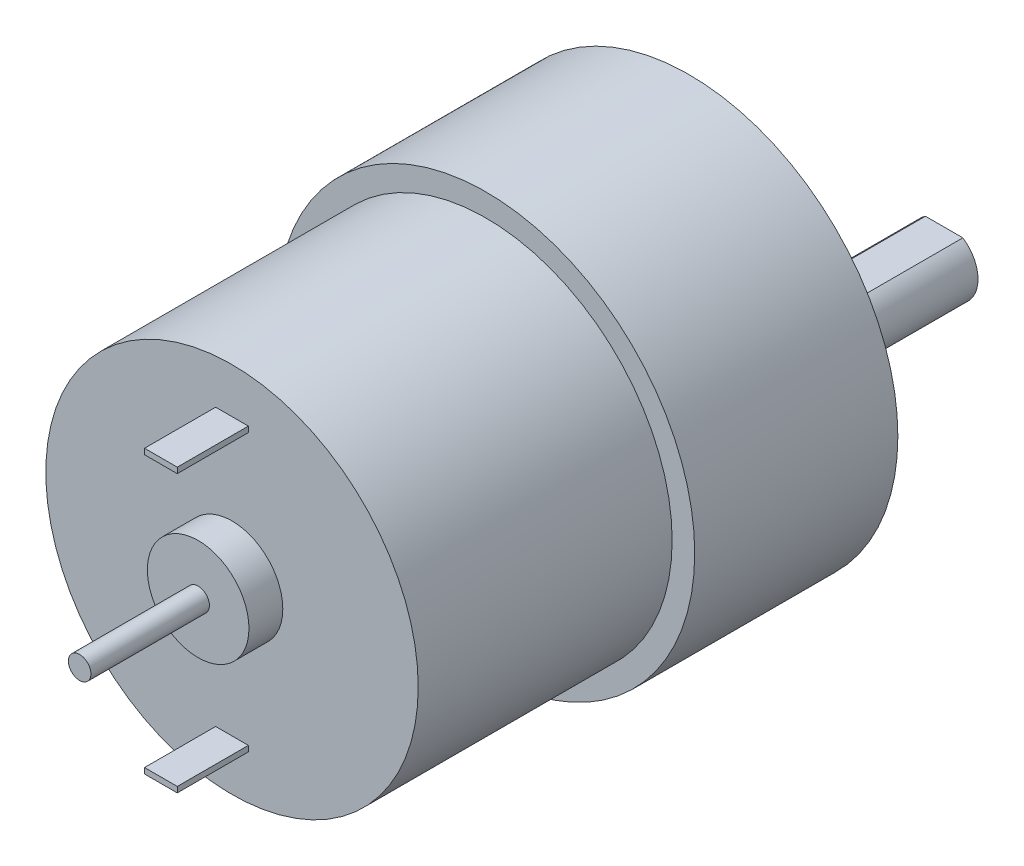
ISO-10303-21;
HEADER;
FILE_DESCRIPTION(('STEP AP214'),'2;1');
FILE_NAME('part.step','',(''),(''),'','','');
FILE_SCHEMA(('AUTOMOTIVE_DESIGN { 1 0 10303 214 1 1 1 1 }'));
ENDSEC;
DATA;
#1=APPLICATION_CONTEXT('core data for automotive mechanical design processes');
#2=APPLICATION_PROTOCOL_DEFINITION('international standard','automotive_design',2000,#1);
#3=PRODUCT_CONTEXT('',#1,'mechanical');
#4=PRODUCT('Part','Part','',(#3));
#5=PRODUCT_RELATED_PRODUCT_CATEGORY('part','',(#4));
#6=PRODUCT_DEFINITION_FORMATION('','',#4);
#7=PRODUCT_DEFINITION_CONTEXT('part definition',#1,'design');
#8=PRODUCT_DEFINITION('design','',#6,#7);
#9=PRODUCT_DEFINITION_SHAPE('','',#8);
#10=(LENGTH_UNIT() NAMED_UNIT(*) SI_UNIT(.MILLI.,.METRE.));
#11=(NAMED_UNIT(*) PLANE_ANGLE_UNIT() SI_UNIT($,.RADIAN.));
#12=(NAMED_UNIT(*) SI_UNIT($,.STERADIAN.) SOLID_ANGLE_UNIT());
#13=UNCERTAINTY_MEASURE_WITH_UNIT(LENGTH_MEASURE(1.E-05),#10,'distance_accuracy_value','');
#14=(GEOMETRIC_REPRESENTATION_CONTEXT(3) GLOBAL_UNCERTAINTY_ASSIGNED_CONTEXT((#13)) GLOBAL_UNIT_ASSIGNED_CONTEXT((#10,
#11,#12)) REPRESENTATION_CONTEXT('',''));
#15=CARTESIAN_POINT('',(0.,0.,0.));
#16=DIRECTION('',(0.,0.,1.));
#17=DIRECTION('',(1.,0.,0.));
#18=AXIS2_PLACEMENT_3D('',#15,#16,#17);
#19=CARTESIAN_POINT('',(0.,-7.,-4.6));
#20=DIRECTION('',(0.,0.,-1.));
#21=DIRECTION('',(-1.,0.,0.));
#22=AXIS2_PLACEMENT_3D('',#19,#20,#21);
#23=PLANE('',#22);
#24=CARTESIAN_POINT('',(0.,-7.,-4.6));
#25=DIRECTION('',(0.,0.,-1.));
#26=DIRECTION('',(-1.,0.,0.));
#27=AXIS2_PLACEMENT_3D('',#24,#25,#26);
#28=CIRCLE('',#27,6.);
#29=CARTESIAN_POINT('',(-6.,-7.,-4.6));
#30=VERTEX_POINT('',#29);
#31=EDGE_CURVE('E143',#30,#30,#28,.T.);
#32=ORIENTED_EDGE('',*,*,#31,.T.);
#33=EDGE_LOOP('',(#32));
#34=FACE_BOUND('',#33,.T.);
#35=CARTESIAN_POINT('',(0.,-7.,-4.6));
#36=DIRECTION('',(0.,0.,-1.));
#37=DIRECTION('',(-1.,0.,0.));
#38=AXIS2_PLACEMENT_3D('',#35,#36,#37);
#39=CIRCLE('',#38,3.);
#40=CARTESIAN_POINT('',(-3.,-7.,-4.6));
#41=VERTEX_POINT('',#40);
#42=EDGE_CURVE('E129',#41,#41,#39,.T.);
#43=ORIENTED_EDGE('',*,*,#42,.F.);
#44=EDGE_LOOP('',(#43));
#45=FACE_BOUND('',#44,.T.);
#46=ADVANCED_FACE('F32',(#34,#45),#23,.T.);
#47=CARTESIAN_POINT('',(0.,0.,0.));
#48=DIRECTION('',(0.,0.,1.));
#49=DIRECTION('',(1.,0.,0.));
#50=AXIS2_PLACEMENT_3D('',#47,#48,#49);
#51=PLANE('',#50);
#52=CARTESIAN_POINT('',(-15.5,0.,0.));
#53=DIRECTION('',(0.,0.,-1.));
#54=DIRECTION('',(-1.,0.,0.));
#55=AXIS2_PLACEMENT_3D('',#52,#53,#54);
#56=CIRCLE('',#55,1.5);
#57=CARTESIAN_POINT('',(-17.,0.,0.));
#58=VERTEX_POINT('',#57);
#59=EDGE_CURVE('E510',#58,#58,#56,.T.);
#60=ORIENTED_EDGE('',*,*,#59,.F.);
#61=EDGE_LOOP('',(#60));
#62=FACE_BOUND('',#61,.T.);
#63=CARTESIAN_POINT('',(7.75000000000006,-13.4233937586588,0.));
#64=DIRECTION('',(0.,0.,-1.));
#65=DIRECTION('',(-1.,0.,0.));
#66=AXIS2_PLACEMENT_3D('',#63,#64,#65);
#67=CIRCLE('',#66,1.5);
#68=CARTESIAN_POINT('',(6.25000000000006,-13.4233937586588,0.));
#69=VERTEX_POINT('',#68);
#70=EDGE_CURVE('E509',#69,#69,#67,.T.);
#71=ORIENTED_EDGE('',*,*,#70,.F.);
#72=EDGE_LOOP('',(#71));
#73=FACE_BOUND('',#72,.T.);
#74=CARTESIAN_POINT('',(15.5,0.,0.));
#75=DIRECTION('',(0.,0.,-1.));
#76=DIRECTION('',(-1.,0.,0.));
#77=AXIS2_PLACEMENT_3D('',#74,#75,#76);
#78=CIRCLE('',#77,1.5);
#79=CARTESIAN_POINT('',(14.,0.,0.));
#80=VERTEX_POINT('',#79);
#81=EDGE_CURVE('E519',#80,#80,#78,.T.);
#82=ORIENTED_EDGE('',*,*,#81,.F.);
#83=EDGE_LOOP('',(#82));
#84=FACE_BOUND('',#83,.T.);
#85=CARTESIAN_POINT('',(7.74999999999997,13.4233937586588,0.));
#86=DIRECTION('',(0.,0.,-1.));
#87=DIRECTION('',(-1.,0.,0.));
#88=AXIS2_PLACEMENT_3D('',#85,#86,#87);
#89=CIRCLE('',#88,1.5);
#90=CARTESIAN_POINT('',(6.24999999999997,13.4233937586588,0.));
#91=VERTEX_POINT('',#90);
#92=EDGE_CURVE('E524',#91,#91,#89,.T.);
#93=ORIENTED_EDGE('',*,*,#92,.F.);
#94=EDGE_LOOP('',(#93));
#95=FACE_BOUND('',#94,.T.);
#96=CARTESIAN_POINT('',(0.,0.,0.));
#97=DIRECTION('',(0.,0.,1.));
#98=DIRECTION('',(1.,0.,0.));
#99=AXIS2_PLACEMENT_3D('',#96,#97,#98);
#100=CIRCLE('',#99,18.5);
#101=CARTESIAN_POINT('',(18.5,0.,0.));
#102=VERTEX_POINT('',#101);
#103=EDGE_CURVE('E218',#102,#102,#100,.T.);
#104=ORIENTED_EDGE('',*,*,#103,.F.);
#105=EDGE_LOOP('',(#104));
#106=FACE_BOUND('',#105,.T.);
#107=CARTESIAN_POINT('',(0.,-7.,0.));
#108=DIRECTION('',(0.,0.,1.));
#109=DIRECTION('',(1.,0.,0.));
#110=AXIS2_PLACEMENT_3D('',#107,#108,#109);
#111=CIRCLE('',#110,6.);
#112=CARTESIAN_POINT('',(6.,-7.,0.));
#113=VERTEX_POINT('',#112);
#114=EDGE_CURVE('E11',#113,#113,#111,.F.);
#115=ORIENTED_EDGE('',*,*,#114,.F.);
#116=EDGE_LOOP('',(#115));
#117=FACE_BOUND('',#116,.T.);
#118=ADVANCED_FACE('F236',(#62,#73,#84,#95,#106,#117),#51,.F.);
#119=CARTESIAN_POINT('',(0.,0.,40.5));
#120=DIRECTION('',(0.,0.,1.));
#121=DIRECTION('',(1.,0.,0.));
#122=AXIS2_PLACEMENT_3D('',#119,#120,#121);
#123=PLANE('',#122);
#124=DIRECTION('',(1.,0.,0.));
#125=VECTOR('',#124,1.);
#126=CARTESIAN_POINT('',(1.45,-12.5,40.5));
#127=LINE('',#126,#125);
#128=CARTESIAN_POINT('',(-1.45,-12.5,40.5));
#129=VERTEX_POINT('',#128);
#130=CARTESIAN_POINT('',(1.45,-12.5,40.5));
#131=VERTEX_POINT('',#130);
#132=EDGE_CURVE('E187',#129,#131,#127,.T.);
#133=ORIENTED_EDGE('',*,*,#132,.F.);
#134=DIRECTION('',(0.,-1.,0.));
#135=VECTOR('',#134,1.);
#136=CARTESIAN_POINT('',(-1.45,-12.5,40.5));
#137=LINE('',#136,#135);
#138=CARTESIAN_POINT('',(-1.45,-12.,40.5));
#139=VERTEX_POINT('',#138);
#140=EDGE_CURVE('E173',#139,#129,#137,.T.);
#141=ORIENTED_EDGE('',*,*,#140,.F.);
#142=DIRECTION('',(-1.,0.,0.));
#143=VECTOR('',#142,1.);
#144=CARTESIAN_POINT('',(1.45,-12.,40.5));
#145=LINE('',#144,#143);
#146=CARTESIAN_POINT('',(1.45,-12.,40.5));
#147=VERTEX_POINT('',#146);
#148=EDGE_CURVE('E178',#147,#139,#145,.T.);
#149=ORIENTED_EDGE('',*,*,#148,.F.);
#150=DIRECTION('',(0.,1.,0.));
#151=VECTOR('',#150,1.);
#152=CARTESIAN_POINT('',(1.45,-12.5,40.5));
#153=LINE('',#152,#151);
#154=EDGE_CURVE('E189',#131,#147,#153,.T.);
#155=ORIENTED_EDGE('',*,*,#154,.F.);
#156=EDGE_LOOP('',(#133,#141,#149,#155));
#157=FACE_BOUND('',#156,.T.);
#158=CARTESIAN_POINT('',(0.,0.,40.5));
#159=DIRECTION('',(0.,0.,1.));
#160=DIRECTION('',(1.,0.,0.));
#161=AXIS2_PLACEMENT_3D('',#158,#159,#160);
#162=CIRCLE('',#161,16.5);
#163=CARTESIAN_POINT('',(16.5,0.,40.5));
#164=VERTEX_POINT('',#163);
#165=EDGE_CURVE('E215',#164,#164,#162,.T.);
#166=ORIENTED_EDGE('',*,*,#165,.T.);
#167=EDGE_LOOP('',(#166));
#168=FACE_BOUND('',#167,.T.);
#169=CARTESIAN_POINT('',(0.,0.,40.5));
#170=DIRECTION('',(0.,0.,1.));
#171=DIRECTION('',(1.,0.,0.));
#172=AXIS2_PLACEMENT_3D('',#169,#170,#171);
#173=CIRCLE('',#172,4.5);
#174=CARTESIAN_POINT('',(4.5,0.,40.5));
#175=VERTEX_POINT('',#174);
#176=EDGE_CURVE('E206',#175,#175,#173,.T.);
#177=ORIENTED_EDGE('',*,*,#176,.F.);
#178=EDGE_LOOP('',(#177));
#179=FACE_BOUND('',#178,.T.);
#180=DIRECTION('',(1.,0.,0.));
#181=VECTOR('',#180,1.);
#182=CARTESIAN_POINT('',(1.45,12.,40.5));
#183=LINE('',#182,#181);
#184=CARTESIAN_POINT('',(-1.45,12.,40.5));
#185=VERTEX_POINT('',#184);
#186=CARTESIAN_POINT('',(1.45,12.,40.5));
#187=VERTEX_POINT('',#186);
#188=EDGE_CURVE('E160',#185,#187,#183,.T.);
#189=ORIENTED_EDGE('',*,*,#188,.F.);
#190=DIRECTION('',(0.,-1.,0.));
#191=VECTOR('',#190,1.);
#192=CARTESIAN_POINT('',(-1.45,12.5,40.5));
#193=LINE('',#192,#191);
#194=CARTESIAN_POINT('',(-1.45,12.5,40.5));
#195=VERTEX_POINT('',#194);
#196=EDGE_CURVE('E146',#195,#185,#193,.T.);
#197=ORIENTED_EDGE('',*,*,#196,.F.);
#198=DIRECTION('',(-1.,0.,0.));
#199=VECTOR('',#198,1.);
#200=CARTESIAN_POINT('',(1.45,12.5,40.5));
#201=LINE('',#200,#199);
#202=CARTESIAN_POINT('',(1.45,12.5,40.5));
#203=VERTEX_POINT('',#202);
#204=EDGE_CURVE('E151',#203,#195,#201,.T.);
#205=ORIENTED_EDGE('',*,*,#204,.F.);
#206=DIRECTION('',(0.,1.,0.));
#207=VECTOR('',#206,1.);
#208=CARTESIAN_POINT('',(1.45,12.5,40.5));
#209=LINE('',#208,#207);
#210=EDGE_CURVE('E162',#187,#203,#209,.T.);
#211=ORIENTED_EDGE('',*,*,#210,.F.);
#212=EDGE_LOOP('',(#189,#197,#205,#211));
#213=FACE_BOUND('',#212,.T.);
#214=ADVANCED_FACE('F243',(#157,#168,#179,#213),#123,.T.);
#215=CARTESIAN_POINT('',(0.,0.,43.5));
#216=DIRECTION('',(0.,0.,1.));
#217=DIRECTION('',(1.,0.,0.));
#218=AXIS2_PLACEMENT_3D('',#215,#216,#217);
#219=PLANE('',#218);
#220=CARTESIAN_POINT('',(0.,0.,43.5));
#221=DIRECTION('',(0.,0.,1.));
#222=DIRECTION('',(1.,0.,0.));
#223=AXIS2_PLACEMENT_3D('',#220,#221,#222);
#224=CIRCLE('',#223,4.5);
#225=CARTESIAN_POINT('',(4.5,0.,43.5));
#226=VERTEX_POINT('',#225);
#227=EDGE_CURVE('E209',#226,#226,#224,.T.);
#228=ORIENTED_EDGE('',*,*,#227,.T.);
#229=EDGE_LOOP('',(#228));
#230=FACE_BOUND('',#229,.T.);
#231=CARTESIAN_POINT('',(0.,0.,43.5));
#232=DIRECTION('',(0.,0.,1.));
#233=DIRECTION('',(1.,0.,0.));
#234=AXIS2_PLACEMENT_3D('',#231,#232,#233);
#235=CIRCLE('',#234,1.);
#236=CARTESIAN_POINT('',(1.,0.,43.5));
#237=VERTEX_POINT('',#236);
#238=EDGE_CURVE('E202',#237,#237,#235,.T.);
#239=ORIENTED_EDGE('',*,*,#238,.F.);
#240=EDGE_LOOP('',(#239));
#241=FACE_BOUND('',#240,.T.);
#242=ADVANCED_FACE('F298',(#230,#241),#219,.T.);
#243=CARTESIAN_POINT('',(0.,0.,18.));
#244=DIRECTION('',(0.,0.,1.));
#245=DIRECTION('',(1.,0.,0.));
#246=AXIS2_PLACEMENT_3D('',#243,#244,#245);
#247=PLANE('',#246);
#248=CARTESIAN_POINT('',(0.,0.,18.));
#249=DIRECTION('',(0.,0.,1.));
#250=DIRECTION('',(1.,0.,0.));
#251=AXIS2_PLACEMENT_3D('',#248,#249,#250);
#252=CIRCLE('',#251,18.5);
#253=CARTESIAN_POINT('',(18.5,0.,18.));
#254=VERTEX_POINT('',#253);
#255=EDGE_CURVE('E41',#254,#254,#252,.T.);
#256=ORIENTED_EDGE('',*,*,#255,.T.);
#257=EDGE_LOOP('',(#256));
#258=FACE_BOUND('',#257,.T.);
#259=CARTESIAN_POINT('',(0.,0.,18.));
#260=DIRECTION('',(0.,0.,1.));
#261=DIRECTION('',(1.,0.,0.));
#262=AXIS2_PLACEMENT_3D('',#259,#260,#261);
#263=CIRCLE('',#262,16.5);
#264=CARTESIAN_POINT('',(16.5,0.,18.));
#265=VERTEX_POINT('',#264);
#266=EDGE_CURVE('E212',#265,#265,#263,.T.);
#267=ORIENTED_EDGE('',*,*,#266,.F.);
#268=EDGE_LOOP('',(#267));
#269=FACE_BOUND('',#268,.T.);
#270=ADVANCED_FACE('F301',(#258,#269),#247,.T.);
#271=CARTESIAN_POINT('',(0.,0.,18.));
#272=DIRECTION('',(0.,0.,-1.));
#273=DIRECTION('',(-1.,0.,0.));
#274=AXIS2_PLACEMENT_3D('',#271,#272,#273);
#275=CYLINDRICAL_SURFACE('',#274,18.5);
#276=ORIENTED_EDGE('',*,*,#255,.F.);
#277=EDGE_LOOP('',(#276));
#278=FACE_BOUND('',#277,.T.);
#279=ORIENTED_EDGE('',*,*,#103,.T.);
#280=EDGE_LOOP('',(#279));
#281=FACE_BOUND('',#280,.T.);
#282=ADVANCED_FACE('F34',(#278,#281),#275,.T.);
#283=CARTESIAN_POINT('',(0.,0.,40.5));
#284=DIRECTION('',(0.,0.,-1.));
#285=DIRECTION('',(-1.,0.,0.));
#286=AXIS2_PLACEMENT_3D('',#283,#284,#285);
#287=CYLINDRICAL_SURFACE('',#286,16.5);
#288=ORIENTED_EDGE('',*,*,#165,.F.);
#289=EDGE_LOOP('',(#288));
#290=FACE_BOUND('',#289,.T.);
#291=ORIENTED_EDGE('',*,*,#266,.T.);
#292=EDGE_LOOP('',(#291));
#293=FACE_BOUND('',#292,.T.);
#294=ADVANCED_FACE('F305',(#290,#293),#287,.T.);
#295=CARTESIAN_POINT('',(0.,0.,43.5));
#296=DIRECTION('',(0.,0.,-1.));
#297=DIRECTION('',(-1.,0.,0.));
#298=AXIS2_PLACEMENT_3D('',#295,#296,#297);
#299=CYLINDRICAL_SURFACE('',#298,4.5);
#300=ORIENTED_EDGE('',*,*,#227,.F.);
#301=EDGE_LOOP('',(#300));
#302=FACE_BOUND('',#301,.T.);
#303=ORIENTED_EDGE('',*,*,#176,.T.);
#304=EDGE_LOOP('',(#303));
#305=FACE_BOUND('',#304,.T.);
#306=ADVANCED_FACE('F296',(#302,#305),#299,.T.);
#307=CARTESIAN_POINT('',(0.,0.,54.));
#308=DIRECTION('',(0.,0.,-1.));
#309=DIRECTION('',(-1.,0.,0.));
#310=AXIS2_PLACEMENT_3D('',#307,#308,#309);
#311=CYLINDRICAL_SURFACE('',#310,1.);
#312=CARTESIAN_POINT('',(0.,0.,54.));
#313=DIRECTION('',(0.,0.,1.));
#314=DIRECTION('',(1.,0.,0.));
#315=AXIS2_PLACEMENT_3D('',#312,#313,#314);
#316=CIRCLE('',#315,1.);
#317=CARTESIAN_POINT('',(1.,0.,54.));
#318=VERTEX_POINT('',#317);
#319=EDGE_CURVE('E203',#318,#318,#316,.T.);
#320=ORIENTED_EDGE('',*,*,#319,.F.);
#321=EDGE_LOOP('',(#320));
#322=FACE_BOUND('',#321,.T.);
#323=ORIENTED_EDGE('',*,*,#238,.T.);
#324=EDGE_LOOP('',(#323));
#325=FACE_BOUND('',#324,.T.);
#326=ADVANCED_FACE('F292',(#322,#325),#311,.T.);
#327=CARTESIAN_POINT('',(0.,0.,54.));
#328=DIRECTION('',(0.,0.,1.));
#329=DIRECTION('',(1.,0.,0.));
#330=AXIS2_PLACEMENT_3D('',#327,#328,#329);
#331=PLANE('',#330);
#332=ORIENTED_EDGE('',*,*,#319,.T.);
#333=EDGE_LOOP('',(#332));
#334=FACE_BOUND('',#333,.T.);
#335=ADVANCED_FACE('F288',(#334),#331,.T.);
#336=CARTESIAN_POINT('',(-1.45,-12.5,46.8));
#337=DIRECTION('',(1.,0.,0.));
#338=DIRECTION('',(0.,0.,-1.));
#339=AXIS2_PLACEMENT_3D('',#336,#337,#338);
#340=PLANE('',#339);
#341=ORIENTED_EDGE('',*,*,#140,.T.);
#342=DIRECTION('',(0.,0.,-1.));
#343=VECTOR('',#342,1.);
#344=CARTESIAN_POINT('',(-1.45,-12.5,46.8));
#345=LINE('',#344,#343);
#346=CARTESIAN_POINT('',(-1.45,-12.5,46.8));
#347=VERTEX_POINT('',#346);
#348=EDGE_CURVE('E200',#347,#129,#345,.T.);
#349=ORIENTED_EDGE('',*,*,#348,.F.);
#350=DIRECTION('',(0.,-1.,0.));
#351=VECTOR('',#350,1.);
#352=CARTESIAN_POINT('',(-1.45,-12.5,46.8));
#353=LINE('',#352,#351);
#354=CARTESIAN_POINT('',(-1.45,-12.,46.8));
#355=VERTEX_POINT('',#354);
#356=EDGE_CURVE('E174',#355,#347,#353,.T.);
#357=ORIENTED_EDGE('',*,*,#356,.F.);
#358=DIRECTION('',(0.,0.,-1.));
#359=VECTOR('',#358,1.);
#360=CARTESIAN_POINT('',(-1.45,-12.,46.8));
#361=LINE('',#360,#359);
#362=EDGE_CURVE('E184',#355,#139,#361,.T.);
#363=ORIENTED_EDGE('',*,*,#362,.T.);
#364=EDGE_LOOP('',(#341,#349,#357,#363));
#365=FACE_BOUND('',#364,.T.);
#366=ADVANCED_FACE('F284',(#365),#340,.F.);
#367=CARTESIAN_POINT('',(1.45,-12.5,46.8));
#368=DIRECTION('',(0.,1.,0.));
#369=DIRECTION('',(0.,0.,1.));
#370=AXIS2_PLACEMENT_3D('',#367,#368,#369);
#371=PLANE('',#370);
#372=ORIENTED_EDGE('',*,*,#132,.T.);
#373=DIRECTION('',(0.,0.,-1.));
#374=VECTOR('',#373,1.);
#375=CARTESIAN_POINT('',(1.45,-12.5,46.8));
#376=LINE('',#375,#374);
#377=CARTESIAN_POINT('',(1.45,-12.5,46.8));
#378=VERTEX_POINT('',#377);
#379=EDGE_CURVE('E197',#378,#131,#376,.T.);
#380=ORIENTED_EDGE('',*,*,#379,.F.);
#381=DIRECTION('',(1.,0.,0.));
#382=VECTOR('',#381,1.);
#383=CARTESIAN_POINT('',(1.45,-12.5,46.8));
#384=LINE('',#383,#382);
#385=EDGE_CURVE('E177',#347,#378,#384,.T.);
#386=ORIENTED_EDGE('',*,*,#385,.F.);
#387=ORIENTED_EDGE('',*,*,#348,.T.);
#388=EDGE_LOOP('',(#372,#380,#386,#387));
#389=FACE_BOUND('',#388,.T.);
#390=ADVANCED_FACE('F280',(#389),#371,.F.);
#391=CARTESIAN_POINT('',(1.45,-12.5,46.8));
#392=DIRECTION('',(-1.,0.,0.));
#393=DIRECTION('',(0.,0.,1.));
#394=AXIS2_PLACEMENT_3D('',#391,#392,#393);
#395=PLANE('',#394);
#396=ORIENTED_EDGE('',*,*,#154,.T.);
#397=DIRECTION('',(0.,0.,-1.));
#398=VECTOR('',#397,1.);
#399=CARTESIAN_POINT('',(1.45,-12.,46.8));
#400=LINE('',#399,#398);
#401=CARTESIAN_POINT('',(1.45,-12.,46.8));
#402=VERTEX_POINT('',#401);
#403=EDGE_CURVE('E195',#402,#147,#400,.T.);
#404=ORIENTED_EDGE('',*,*,#403,.F.);
#405=DIRECTION('',(0.,1.,0.));
#406=VECTOR('',#405,1.);
#407=CARTESIAN_POINT('',(1.45,-12.5,46.8));
#408=LINE('',#407,#406);
#409=EDGE_CURVE('E180',#378,#402,#408,.T.);
#410=ORIENTED_EDGE('',*,*,#409,.F.);
#411=ORIENTED_EDGE('',*,*,#379,.T.);
#412=EDGE_LOOP('',(#396,#404,#410,#411));
#413=FACE_BOUND('',#412,.T.);
#414=ADVANCED_FACE('F276',(#413),#395,.F.);
#415=CARTESIAN_POINT('',(1.45,-12.,46.8));
#416=DIRECTION('',(0.,-1.,0.));
#417=DIRECTION('',(0.,0.,-1.));
#418=AXIS2_PLACEMENT_3D('',#415,#416,#417);
#419=PLANE('',#418);
#420=ORIENTED_EDGE('',*,*,#148,.T.);
#421=ORIENTED_EDGE('',*,*,#362,.F.);
#422=DIRECTION('',(-1.,0.,0.));
#423=VECTOR('',#422,1.);
#424=CARTESIAN_POINT('',(1.45,-12.,46.8));
#425=LINE('',#424,#423);
#426=EDGE_CURVE('E182',#402,#355,#425,.T.);
#427=ORIENTED_EDGE('',*,*,#426,.F.);
#428=ORIENTED_EDGE('',*,*,#403,.T.);
#429=EDGE_LOOP('',(#420,#421,#427,#428));
#430=FACE_BOUND('',#429,.T.);
#431=ADVANCED_FACE('F272',(#430),#419,.F.);
#432=CARTESIAN_POINT('',(-1.45,-12.,46.8));
#433=DIRECTION('',(0.,0.,1.));
#434=DIRECTION('',(1.,0.,0.));
#435=AXIS2_PLACEMENT_3D('',#432,#433,#434);
#436=PLANE('',#435);
#437=ORIENTED_EDGE('',*,*,#356,.T.);
#438=ORIENTED_EDGE('',*,*,#385,.T.);
#439=ORIENTED_EDGE('',*,*,#409,.T.);
#440=ORIENTED_EDGE('',*,*,#426,.T.);
#441=EDGE_LOOP('',(#437,#438,#439,#440));
#442=FACE_BOUND('',#441,.T.);
#443=ADVANCED_FACE('F268',(#442),#436,.T.);
#444=CARTESIAN_POINT('',(-1.45,12.5,46.8));
#445=DIRECTION('',(1.,0.,0.));
#446=DIRECTION('',(0.,1.,0.));
#447=AXIS2_PLACEMENT_3D('',#444,#445,#446);
#448=PLANE('',#447);
#449=ORIENTED_EDGE('',*,*,#196,.T.);
#450=DIRECTION('',(0.,0.,-1.));
#451=VECTOR('',#450,1.);
#452=CARTESIAN_POINT('',(-1.45,12.,46.8));
#453=LINE('',#452,#451);
#454=CARTESIAN_POINT('',(-1.45,12.,46.8));
#455=VERTEX_POINT('',#454);
#456=EDGE_CURVE('E171',#455,#185,#453,.T.);
#457=ORIENTED_EDGE('',*,*,#456,.F.);
#458=DIRECTION('',(0.,-1.,0.));
#459=VECTOR('',#458,1.);
#460=CARTESIAN_POINT('',(-1.45,12.5,46.8));
#461=LINE('',#460,#459);
#462=CARTESIAN_POINT('',(-1.45,12.5,46.8));
#463=VERTEX_POINT('',#462);
#464=EDGE_CURVE('E147',#463,#455,#461,.T.);
#465=ORIENTED_EDGE('',*,*,#464,.F.);
#466=DIRECTION('',(0.,0.,-1.));
#467=VECTOR('',#466,1.);
#468=CARTESIAN_POINT('',(-1.45,12.5,46.8));
#469=LINE('',#468,#467);
#470=EDGE_CURVE('E157',#463,#195,#469,.T.);
#471=ORIENTED_EDGE('',*,*,#470,.T.);
#472=EDGE_LOOP('',(#449,#457,#465,#471));
#473=FACE_BOUND('',#472,.T.);
#474=ADVANCED_FACE('F264',(#473),#448,.F.);
#475=CARTESIAN_POINT('',(1.45,12.,46.8));
#476=DIRECTION('',(0.,1.,0.));
#477=DIRECTION('',(-1.,0.,0.));
#478=AXIS2_PLACEMENT_3D('',#475,#476,#477);
#479=PLANE('',#478);
#480=ORIENTED_EDGE('',*,*,#188,.T.);
#481=DIRECTION('',(0.,0.,-1.));
#482=VECTOR('',#481,1.);
#483=CARTESIAN_POINT('',(1.45,12.,46.8));
#484=LINE('',#483,#482);
#485=CARTESIAN_POINT('',(1.45,12.,46.8));
#486=VERTEX_POINT('',#485);
#487=EDGE_CURVE('E168',#486,#187,#484,.T.);
#488=ORIENTED_EDGE('',*,*,#487,.F.);
#489=DIRECTION('',(1.,0.,0.));
#490=VECTOR('',#489,1.);
#491=CARTESIAN_POINT('',(1.45,12.,46.8));
#492=LINE('',#491,#490);
#493=EDGE_CURVE('E150',#455,#486,#492,.T.);
#494=ORIENTED_EDGE('',*,*,#493,.F.);
#495=ORIENTED_EDGE('',*,*,#456,.T.);
#496=EDGE_LOOP('',(#480,#488,#494,#495));
#497=FACE_BOUND('',#496,.T.);
#498=ADVANCED_FACE('F260',(#497),#479,.F.);
#499=CARTESIAN_POINT('',(1.45,12.5,46.8));
#500=DIRECTION('',(-1.,0.,0.));
#501=DIRECTION('',(0.,0.,1.));
#502=AXIS2_PLACEMENT_3D('',#499,#500,#501);
#503=PLANE('',#502);
#504=ORIENTED_EDGE('',*,*,#210,.T.);
#505=DIRECTION('',(0.,0.,-1.));
#506=VECTOR('',#505,1.);
#507=CARTESIAN_POINT('',(1.45,12.5,46.8));
#508=LINE('',#507,#506);
#509=CARTESIAN_POINT('',(1.45,12.5,46.8));
#510=VERTEX_POINT('',#509);
#511=EDGE_CURVE('E56',#510,#203,#508,.T.);
#512=ORIENTED_EDGE('',*,*,#511,.F.);
#513=DIRECTION('',(0.,1.,0.));
#514=VECTOR('',#513,1.);
#515=CARTESIAN_POINT('',(1.45,12.5,46.8));
#516=LINE('',#515,#514);
#517=EDGE_CURVE('E153',#486,#510,#516,.T.);
#518=ORIENTED_EDGE('',*,*,#517,.F.);
#519=ORIENTED_EDGE('',*,*,#487,.T.);
#520=EDGE_LOOP('',(#504,#512,#518,#519));
#521=FACE_BOUND('',#520,.T.);
#522=ADVANCED_FACE('F257',(#521),#503,.F.);
#523=CARTESIAN_POINT('',(1.45,12.5,46.8));
#524=DIRECTION('',(0.,-1.,0.));
#525=DIRECTION('',(1.,0.,0.));
#526=AXIS2_PLACEMENT_3D('',#523,#524,#525);
#527=PLANE('',#526);
#528=ORIENTED_EDGE('',*,*,#204,.T.);
#529=ORIENTED_EDGE('',*,*,#470,.F.);
#530=DIRECTION('',(-1.,0.,0.));
#531=VECTOR('',#530,1.);
#532=CARTESIAN_POINT('',(1.45,12.5,46.8));
#533=LINE('',#532,#531);
#534=EDGE_CURVE('E155',#510,#463,#533,.T.);
#535=ORIENTED_EDGE('',*,*,#534,.F.);
#536=ORIENTED_EDGE('',*,*,#511,.T.);
#537=EDGE_LOOP('',(#528,#529,#535,#536));
#538=FACE_BOUND('',#537,.T.);
#539=ADVANCED_FACE('F253',(#538),#527,.F.);
#540=CARTESIAN_POINT('',(-1.45,12.,46.8));
#541=DIRECTION('',(0.,0.,-1.));
#542=DIRECTION('',(-1.,0.,0.));
#543=AXIS2_PLACEMENT_3D('',#540,#541,#542);
#544=PLANE('',#543);
#545=ORIENTED_EDGE('',*,*,#464,.T.);
#546=ORIENTED_EDGE('',*,*,#493,.T.);
#547=ORIENTED_EDGE('',*,*,#517,.T.);
#548=ORIENTED_EDGE('',*,*,#534,.T.);
#549=EDGE_LOOP('',(#545,#546,#547,#548));
#550=FACE_BOUND('',#549,.T.);
#551=ADVANCED_FACE('F249',(#550),#544,.F.);
#552=CARTESIAN_POINT('',(0.,-7.,-4.6));
#553=DIRECTION('',(0.,0.,1.));
#554=DIRECTION('',(1.,0.,0.));
#555=AXIS2_PLACEMENT_3D('',#552,#553,#554);
#556=CYLINDRICAL_SURFACE('',#555,6.);
#557=ORIENTED_EDGE('',*,*,#31,.F.);
#558=EDGE_LOOP('',(#557));
#559=FACE_BOUND('',#558,.T.);
#560=ORIENTED_EDGE('',*,*,#114,.T.);
#561=EDGE_LOOP('',(#560));
#562=FACE_BOUND('',#561,.T.);
#563=ADVANCED_FACE('F233',(#559,#562),#556,.T.);
#564=CARTESIAN_POINT('',(0.,-7.,-10.6));
#565=DIRECTION('',(0.,0.,1.));
#566=DIRECTION('',(1.,0.,0.));
#567=AXIS2_PLACEMENT_3D('',#564,#565,#566);
#568=CYLINDRICAL_SURFACE('',#567,3.);
#569=CARTESIAN_POINT('',(0.,-7.,-10.6));
#570=DIRECTION('',(0.,0.,-1.));
#571=DIRECTION('',(-1.,0.,0.));
#572=AXIS2_PLACEMENT_3D('',#569,#570,#571);
#573=CIRCLE('',#572,3.);
#574=CARTESIAN_POINT('',(-1.6583123951777,-4.5,-10.6));
#575=VERTEX_POINT('',#574);
#576=CARTESIAN_POINT('',(1.6583123951777,-4.5,-10.6));
#577=VERTEX_POINT('',#576);
#578=EDGE_CURVE('E128',#575,#577,#573,.T.);
#579=ORIENTED_EDGE('',*,*,#578,.F.);
#580=DIRECTION('',(0.,0.,1.));
#581=VECTOR('',#580,1.);
#582=CARTESIAN_POINT('',(-1.6583123951777,-4.5,-22.6));
#583=LINE('',#582,#581);
#584=CARTESIAN_POINT('',(-1.6583123951777,-4.5,-22.6));
#585=VERTEX_POINT('',#584);
#586=EDGE_CURVE('E116',#585,#575,#583,.T.);
#587=ORIENTED_EDGE('',*,*,#586,.F.);
#588=CARTESIAN_POINT('',(0.,-7.,-22.6));
#589=DIRECTION('',(0.,0.,-1.));
#590=DIRECTION('',(1.,0.,0.));
#591=AXIS2_PLACEMENT_3D('',#588,#589,#590);
#592=CIRCLE('',#591,3.);
#593=CARTESIAN_POINT('',(1.6583123951777,-4.5,-22.6));
#594=VERTEX_POINT('',#593);
#595=EDGE_CURVE('E121',#594,#585,#592,.T.);
#596=ORIENTED_EDGE('',*,*,#595,.F.);
#597=DIRECTION('',(0.,0.,1.));
#598=VECTOR('',#597,1.);
#599=CARTESIAN_POINT('',(1.6583123951777,-4.5,-22.6));
#600=LINE('',#599,#598);
#601=EDGE_CURVE('E118',#594,#577,#600,.T.);
#602=ORIENTED_EDGE('',*,*,#601,.T.);
#603=EDGE_LOOP('',(#579,#587,#596,#602));
#604=FACE_BOUND('',#603,.T.);
#605=ORIENTED_EDGE('',*,*,#42,.T.);
#606=EDGE_LOOP('',(#605));
#607=FACE_BOUND('',#606,.T.);
#608=ADVANCED_FACE('F126',(#604,#607),#568,.T.);
#609=CARTESIAN_POINT('',(0.,-7.,-10.6));
#610=DIRECTION('',(0.,0.,-1.));
#611=DIRECTION('',(-1.,0.,0.));
#612=AXIS2_PLACEMENT_3D('',#609,#610,#611);
#613=PLANE('',#612);
#614=DIRECTION('',(1.,0.,0.));
#615=VECTOR('',#614,1.);
#616=CARTESIAN_POINT('',(1.6583123951777,-4.5,-10.6));
#617=LINE('',#616,#615);
#618=EDGE_CURVE('E48',#575,#577,#617,.T.);
#619=ORIENTED_EDGE('',*,*,#618,.F.);
#620=ORIENTED_EDGE('',*,*,#578,.T.);
#621=EDGE_LOOP('',(#619,#620));
#622=FACE_BOUND('',#621,.T.);
#623=ADVANCED_FACE('F224',(#622),#613,.T.);
#624=CARTESIAN_POINT('',(1.6583123951777,-4.5,-22.6));
#625=DIRECTION('',(0.,-1.,0.));
#626=DIRECTION('',(0.,0.,-1.));
#627=AXIS2_PLACEMENT_3D('',#624,#625,#626);
#628=PLANE('',#627);
#629=ORIENTED_EDGE('',*,*,#618,.T.);
#630=ORIENTED_EDGE('',*,*,#601,.F.);
#631=DIRECTION('',(1.,0.,0.));
#632=VECTOR('',#631,1.);
#633=CARTESIAN_POINT('',(1.6583123951777,-4.5,-22.6));
#634=LINE('',#633,#632);
#635=EDGE_CURVE('E112',#585,#594,#634,.T.);
#636=ORIENTED_EDGE('',*,*,#635,.F.);
#637=ORIENTED_EDGE('',*,*,#586,.T.);
#638=EDGE_LOOP('',(#629,#630,#636,#637));
#639=FACE_BOUND('',#638,.T.);
#640=ADVANCED_FACE('F114',(#639),#628,.F.);
#641=CARTESIAN_POINT('',(0.,-7.,-22.6));
#642=DIRECTION('',(0.,0.,1.));
#643=DIRECTION('',(1.,0.,0.));
#644=AXIS2_PLACEMENT_3D('',#641,#642,#643);
#645=PLANE('',#644);
#646=ORIENTED_EDGE('',*,*,#595,.T.);
#647=ORIENTED_EDGE('',*,*,#635,.T.);
#648=EDGE_LOOP('',(#646,#647));
#649=FACE_BOUND('',#648,.T.);
#650=ADVANCED_FACE('F123',(#649),#645,.F.);
#651=CARTESIAN_POINT('',(7.74999999999997,13.4233937586588,5.));
#652=DIRECTION('',(0.,0.,-1.));
#653=DIRECTION('',(-1.,0.,0.));
#654=AXIS2_PLACEMENT_3D('',#651,#652,#653);
#655=CYLINDRICAL_SURFACE('',#654,1.5);
#656=CARTESIAN_POINT('',(7.74999999999997,13.4233937586588,5.));
#657=DIRECTION('',(0.,0.,-1.));
#658=DIRECTION('',(-1.,0.,0.));
#659=AXIS2_PLACEMENT_3D('',#656,#657,#658);
#660=CIRCLE('',#659,1.5);
#661=CARTESIAN_POINT('',(6.24999999999997,13.4233937586588,5.));
#662=VERTEX_POINT('',#661);
#663=EDGE_CURVE('E138',#662,#662,#660,.T.);
#664=ORIENTED_EDGE('',*,*,#663,.F.);
#665=EDGE_LOOP('',(#664));
#666=FACE_BOUND('',#665,.T.);
#667=ORIENTED_EDGE('',*,*,#92,.T.);
#668=EDGE_LOOP('',(#667));
#669=FACE_BOUND('',#668,.T.);
#670=ADVANCED_FACE('F419',(#666,#669),#655,.F.);
#671=CARTESIAN_POINT('',(7.74999999999997,13.4233937586588,5.));
#672=DIRECTION('',(0.,0.,-1.));
#673=DIRECTION('',(-1.,0.,0.));
#674=AXIS2_PLACEMENT_3D('',#671,#672,#673);
#675=PLANE('',#674);
#676=ORIENTED_EDGE('',*,*,#663,.T.);
#677=EDGE_LOOP('',(#676));
#678=FACE_BOUND('',#677,.T.);
#679=ADVANCED_FACE('F432',(#678),#675,.T.);
#680=CARTESIAN_POINT('',(15.5,0.,5.));
#681=DIRECTION('',(0.,0.,-1.));
#682=DIRECTION('',(-1.,0.,0.));
#683=AXIS2_PLACEMENT_3D('',#680,#681,#682);
#684=CYLINDRICAL_SURFACE('',#683,1.5);
#685=CARTESIAN_POINT('',(15.5,0.,5.));
#686=DIRECTION('',(0.,0.,-1.));
#687=DIRECTION('',(-1.,0.,0.));
#688=AXIS2_PLACEMENT_3D('',#685,#686,#687);
#689=CIRCLE('',#688,1.5);
#690=CARTESIAN_POINT('',(14.,0.,5.));
#691=VERTEX_POINT('',#690);
#692=EDGE_CURVE('E521',#691,#691,#689,.T.);
#693=ORIENTED_EDGE('',*,*,#692,.F.);
#694=EDGE_LOOP('',(#693));
#695=FACE_BOUND('',#694,.T.);
#696=ORIENTED_EDGE('',*,*,#81,.T.);
#697=EDGE_LOOP('',(#696));
#698=FACE_BOUND('',#697,.T.);
#699=ADVANCED_FACE('F442',(#695,#698),#684,.F.);
#700=CARTESIAN_POINT('',(15.5,0.,5.));
#701=DIRECTION('',(0.,0.,-1.));
#702=DIRECTION('',(-1.,0.,0.));
#703=AXIS2_PLACEMENT_3D('',#700,#701,#702);
#704=PLANE('',#703);
#705=ORIENTED_EDGE('',*,*,#692,.T.);
#706=EDGE_LOOP('',(#705));
#707=FACE_BOUND('',#706,.T.);
#708=ADVANCED_FACE('F452',(#707),#704,.T.);
#709=CARTESIAN_POINT('',(7.75000000000006,-13.4233937586588,5.));
#710=DIRECTION('',(0.,0.,-1.));
#711=DIRECTION('',(-1.,0.,0.));
#712=AXIS2_PLACEMENT_3D('',#709,#710,#711);
#713=CYLINDRICAL_SURFACE('',#712,1.5);
#714=CARTESIAN_POINT('',(7.75000000000006,-13.4233937586588,5.));
#715=DIRECTION('',(0.,0.,-1.));
#716=DIRECTION('',(-1.,0.,0.));
#717=AXIS2_PLACEMENT_3D('',#714,#715,#716);
#718=CIRCLE('',#717,1.5);
#719=CARTESIAN_POINT('',(6.25000000000006,-13.4233937586588,5.));
#720=VERTEX_POINT('',#719);
#721=EDGE_CURVE('E513',#720,#720,#718,.T.);
#722=ORIENTED_EDGE('',*,*,#721,.F.);
#723=EDGE_LOOP('',(#722));
#724=FACE_BOUND('',#723,.T.);
#725=ORIENTED_EDGE('',*,*,#70,.T.);
#726=EDGE_LOOP('',(#725));
#727=FACE_BOUND('',#726,.T.);
#728=ADVANCED_FACE('F462',(#724,#727),#713,.F.);
#729=CARTESIAN_POINT('',(7.75000000000006,-13.4233937586588,5.));
#730=DIRECTION('',(0.,0.,-1.));
#731=DIRECTION('',(-1.,0.,0.));
#732=AXIS2_PLACEMENT_3D('',#729,#730,#731);
#733=PLANE('',#732);
#734=ORIENTED_EDGE('',*,*,#721,.T.);
#735=EDGE_LOOP('',(#734));
#736=FACE_BOUND('',#735,.T.);
#737=ADVANCED_FACE('F472',(#736),#733,.T.);
#738=CARTESIAN_POINT('',(-15.5,0.,5.));
#739=DIRECTION('',(0.,0.,-1.));
#740=DIRECTION('',(-1.,0.,0.));
#741=AXIS2_PLACEMENT_3D('',#738,#739,#740);
#742=CYLINDRICAL_SURFACE('',#741,1.5);
#743=CARTESIAN_POINT('',(-15.5,0.,5.));
#744=DIRECTION('',(0.,0.,-1.));
#745=DIRECTION('',(-1.,0.,0.));
#746=AXIS2_PLACEMENT_3D('',#743,#744,#745);
#747=CIRCLE('',#746,1.5);
#748=CARTESIAN_POINT('',(-17.,0.,5.));
#749=VERTEX_POINT('',#748);
#750=EDGE_CURVE('E508',#749,#749,#747,.T.);
#751=ORIENTED_EDGE('',*,*,#750,.F.);
#752=EDGE_LOOP('',(#751));
#753=FACE_BOUND('',#752,.T.);
#754=ORIENTED_EDGE('',*,*,#59,.T.);
#755=EDGE_LOOP('',(#754));
#756=FACE_BOUND('',#755,.T.);
#757=ADVANCED_FACE('F482',(#753,#756),#742,.F.);
#758=CARTESIAN_POINT('',(-15.5,0.,5.));
#759=DIRECTION('',(0.,0.,-1.));
#760=DIRECTION('',(-1.,0.,0.));
#761=AXIS2_PLACEMENT_3D('',#758,#759,#760);
#762=PLANE('',#761);
#763=ORIENTED_EDGE('',*,*,#750,.T.);
#764=EDGE_LOOP('',(#763));
#765=FACE_BOUND('',#764,.T.);
#766=ADVANCED_FACE('F492',(#765),#762,.T.);
#767=CLOSED_SHELL('',(#46,#118,#214,#242,#270,#282,#294,#306,#326,#335,#366,#390,#414,#431,#443,
#474,#498,#522,#539,#551,#563,#608,#623,#640,#650,#670,#679,#699,#708,#728,#737,#757,#766));
#768=MANIFOLD_SOLID_BREP('B2',#767);
#769=ADVANCED_BREP_SHAPE_REPRESENTATION('',(#18,#768),#14);
#770=SHAPE_DEFINITION_REPRESENTATION(#9,#769);
ENDSEC;
END-ISO-10303-21;
